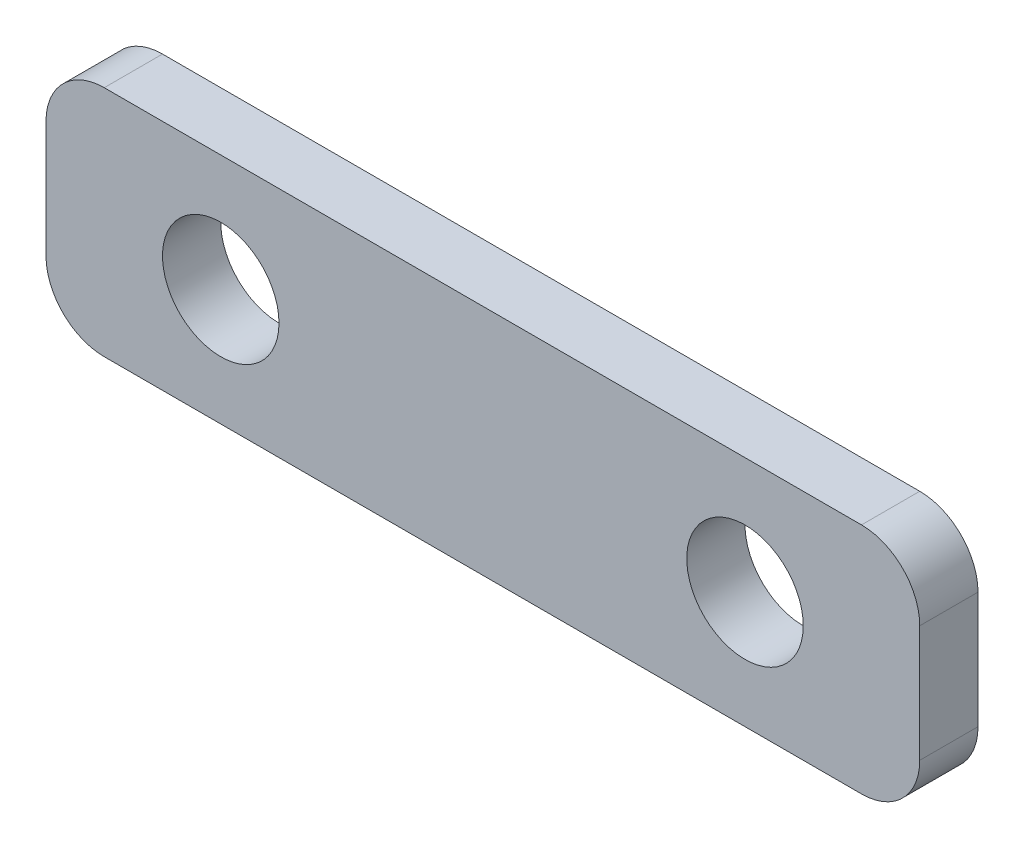
ISO-10303-21;
HEADER;
FILE_DESCRIPTION(('STEP AP214'),'2;1');
FILE_NAME('part.step','',(''),(''),'','','');
FILE_SCHEMA(('AUTOMOTIVE_DESIGN { 1 0 10303 214 1 1 1 1 }'));
ENDSEC;
DATA;
#1=APPLICATION_CONTEXT('core data for automotive mechanical design processes');
#2=APPLICATION_PROTOCOL_DEFINITION('international standard','automotive_design',2000,#1);
#3=PRODUCT_CONTEXT('',#1,'mechanical');
#4=PRODUCT('Part','Part','',(#3));
#5=PRODUCT_RELATED_PRODUCT_CATEGORY('part','',(#4));
#6=PRODUCT_DEFINITION_FORMATION('','',#4);
#7=PRODUCT_DEFINITION_CONTEXT('part definition',#1,'design');
#8=PRODUCT_DEFINITION('design','',#6,#7);
#9=PRODUCT_DEFINITION_SHAPE('','',#8);
#10=(LENGTH_UNIT() NAMED_UNIT(*) SI_UNIT(.MILLI.,.METRE.));
#11=(NAMED_UNIT(*) PLANE_ANGLE_UNIT() SI_UNIT($,.RADIAN.));
#12=(NAMED_UNIT(*) SI_UNIT($,.STERADIAN.) SOLID_ANGLE_UNIT());
#13=UNCERTAINTY_MEASURE_WITH_UNIT(LENGTH_MEASURE(1.E-05),#10,'distance_accuracy_value','');
#14=(GEOMETRIC_REPRESENTATION_CONTEXT(3) GLOBAL_UNCERTAINTY_ASSIGNED_CONTEXT((#13)) GLOBAL_UNIT_ASSIGNED_CONTEXT((#10,
#11,#12)) REPRESENTATION_CONTEXT('',''));
#15=CARTESIAN_POINT('',(0.,0.,0.));
#16=DIRECTION('',(0.,0.,1.));
#17=DIRECTION('',(1.,0.,0.));
#18=AXIS2_PLACEMENT_3D('',#15,#16,#17);
#19=CARTESIAN_POINT('',(-60.,121.755891262732,5.));
#20=DIRECTION('',(0.,0.,1.));
#21=DIRECTION('',(1.,0.,0.));
#22=AXIS2_PLACEMENT_3D('',#19,#20,#21);
#23=PLANE('',#22);
#24=CARTESIAN_POINT('',(-170.,131.755891262732,5.));
#25=DIRECTION('',(0.,0.,1.));
#26=DIRECTION('',(1.,0.,0.));
#27=AXIS2_PLACEMENT_3D('',#24,#25,#26);
#28=CIRCLE('',#27,10.);
#29=CARTESIAN_POINT('',(-160.,131.755891262732,5.));
#30=VERTEX_POINT('',#29);
#31=EDGE_CURVE('E133',#30,#30,#28,.T.);
#32=ORIENTED_EDGE('',*,*,#31,.F.);
#33=EDGE_LOOP('',(#32));
#34=FACE_BOUND('',#33,.T.);
#35=CARTESIAN_POINT('',(-60.,121.755891262732,5.));
#36=DIRECTION('',(0.,0.,1.));
#37=DIRECTION('',(1.,0.,0.));
#38=AXIS2_PLACEMENT_3D('',#35,#36,#37);
#39=CIRCLE('',#38,9.99999999999999);
#40=CARTESIAN_POINT('',(-60.,111.755891262732,5.));
#41=VERTEX_POINT('',#40);
#42=CARTESIAN_POINT('',(-50.,121.755891262732,5.));
#43=VERTEX_POINT('',#42);
#44=EDGE_CURVE('E144',#41,#43,#39,.T.);
#45=ORIENTED_EDGE('',*,*,#44,.T.);
#46=DIRECTION('',(0.,1.,0.));
#47=VECTOR('',#46,1.);
#48=CARTESIAN_POINT('',(-50.,141.755891262732,5.));
#49=LINE('',#48,#47);
#50=CARTESIAN_POINT('',(-50.,141.755891262732,5.));
#51=VERTEX_POINT('',#50);
#52=EDGE_CURVE('E92',#43,#51,#49,.T.);
#53=ORIENTED_EDGE('',*,*,#52,.T.);
#54=CARTESIAN_POINT('',(-60.,141.755891262732,5.));
#55=DIRECTION('',(0.,0.,1.));
#56=DIRECTION('',(-1.,0.,0.));
#57=AXIS2_PLACEMENT_3D('',#54,#55,#56);
#58=CIRCLE('',#57,10.);
#59=CARTESIAN_POINT('',(-60.,151.755891262732,5.));
#60=VERTEX_POINT('',#59);
#61=EDGE_CURVE('E159',#51,#60,#58,.T.);
#62=ORIENTED_EDGE('',*,*,#61,.T.);
#63=DIRECTION('',(-1.,0.,0.));
#64=VECTOR('',#63,1.);
#65=CARTESIAN_POINT('',(-190.,151.755891262732,5.));
#66=LINE('',#65,#64);
#67=CARTESIAN_POINT('',(-190.,151.755891262732,5.));
#68=VERTEX_POINT('',#67);
#69=EDGE_CURVE('E172',#60,#68,#66,.T.);
#70=ORIENTED_EDGE('',*,*,#69,.T.);
#71=CARTESIAN_POINT('',(-190.,141.755891262732,5.));
#72=DIRECTION('',(0.,0.,1.));
#73=DIRECTION('',(1.,0.,0.));
#74=AXIS2_PLACEMENT_3D('',#71,#72,#73);
#75=CIRCLE('',#74,10.);
#76=CARTESIAN_POINT('',(-200.,141.755891262732,5.));
#77=VERTEX_POINT('',#76);
#78=EDGE_CURVE('E111',#68,#77,#75,.T.);
#79=ORIENTED_EDGE('',*,*,#78,.T.);
#80=DIRECTION('',(0.,-1.,0.));
#81=VECTOR('',#80,1.);
#82=CARTESIAN_POINT('',(-200.,141.755891262732,5.));
#83=LINE('',#82,#81);
#84=CARTESIAN_POINT('',(-200.,121.755891262732,5.));
#85=VERTEX_POINT('',#84);
#86=EDGE_CURVE('E105',#77,#85,#83,.T.);
#87=ORIENTED_EDGE('',*,*,#86,.T.);
#88=CARTESIAN_POINT('',(-190.,121.755891262732,5.));
#89=DIRECTION('',(0.,0.,1.));
#90=DIRECTION('',(1.,0.,0.));
#91=AXIS2_PLACEMENT_3D('',#88,#89,#90);
#92=CIRCLE('',#91,10.);
#93=CARTESIAN_POINT('',(-190.,111.755891262732,5.));
#94=VERTEX_POINT('',#93);
#95=EDGE_CURVE('E109',#85,#94,#92,.T.);
#96=ORIENTED_EDGE('',*,*,#95,.T.);
#97=DIRECTION('',(1.,0.,0.));
#98=VECTOR('',#97,1.);
#99=CARTESIAN_POINT('',(-190.,111.755891262732,5.));
#100=LINE('',#99,#98);
#101=EDGE_CURVE('E49',#94,#41,#100,.T.);
#102=ORIENTED_EDGE('',*,*,#101,.T.);
#103=EDGE_LOOP('',(#45,#53,#62,#70,#79,#87,#96,#102));
#104=FACE_BOUND('',#103,.T.);
#105=CARTESIAN_POINT('',(-80.,131.755891262732,5.));
#106=DIRECTION('',(0.,0.,1.));
#107=DIRECTION('',(1.,0.,0.));
#108=AXIS2_PLACEMENT_3D('',#105,#106,#107);
#109=CIRCLE('',#108,10.);
#110=CARTESIAN_POINT('',(-70.,131.755891262732,5.));
#111=VERTEX_POINT('',#110);
#112=EDGE_CURVE('E181',#111,#111,#109,.T.);
#113=ORIENTED_EDGE('',*,*,#112,.F.);
#114=EDGE_LOOP('',(#113));
#115=FACE_BOUND('',#114,.T.);
#116=ADVANCED_FACE('F32',(#34,#104,#115),#23,.T.);
#117=CARTESIAN_POINT('',(-60.,121.755891262732,-5.));
#118=DIRECTION('',(0.,0.,1.));
#119=DIRECTION('',(1.,0.,0.));
#120=AXIS2_PLACEMENT_3D('',#117,#118,#119);
#121=PLANE('',#120);
#122=CARTESIAN_POINT('',(-60.,121.755891262732,-5.));
#123=DIRECTION('',(0.,0.,1.));
#124=DIRECTION('',(1.,0.,0.));
#125=AXIS2_PLACEMENT_3D('',#122,#123,#124);
#126=CIRCLE('',#125,9.99999999999999);
#127=CARTESIAN_POINT('',(-60.,111.755891262732,-5.));
#128=VERTEX_POINT('',#127);
#129=CARTESIAN_POINT('',(-50.,121.755891262732,-5.));
#130=VERTEX_POINT('',#129);
#131=EDGE_CURVE('E129',#128,#130,#126,.T.);
#132=ORIENTED_EDGE('',*,*,#131,.F.);
#133=DIRECTION('',(1.,0.,0.));
#134=VECTOR('',#133,1.);
#135=CARTESIAN_POINT('',(-190.,111.755891262732,-5.));
#136=LINE('',#135,#134);
#137=CARTESIAN_POINT('',(-190.,111.755891262732,-5.));
#138=VERTEX_POINT('',#137);
#139=EDGE_CURVE('E84',#138,#128,#136,.T.);
#140=ORIENTED_EDGE('',*,*,#139,.F.);
#141=CARTESIAN_POINT('',(-190.,121.755891262732,-5.));
#142=DIRECTION('',(0.,0.,1.));
#143=DIRECTION('',(1.,0.,0.));
#144=AXIS2_PLACEMENT_3D('',#141,#142,#143);
#145=CIRCLE('',#144,10.);
#146=CARTESIAN_POINT('',(-200.,121.755891262732,-5.));
#147=VERTEX_POINT('',#146);
#148=EDGE_CURVE('E78',#147,#138,#145,.T.);
#149=ORIENTED_EDGE('',*,*,#148,.F.);
#150=DIRECTION('',(0.,-1.,0.));
#151=VECTOR('',#150,1.);
#152=CARTESIAN_POINT('',(-200.,141.755891262732,-5.));
#153=LINE('',#152,#151);
#154=CARTESIAN_POINT('',(-200.,141.755891262732,-5.));
#155=VERTEX_POINT('',#154);
#156=EDGE_CURVE('E119',#155,#147,#153,.T.);
#157=ORIENTED_EDGE('',*,*,#156,.F.);
#158=CARTESIAN_POINT('',(-190.,141.755891262732,-5.));
#159=DIRECTION('',(0.,0.,1.));
#160=DIRECTION('',(1.,0.,0.));
#161=AXIS2_PLACEMENT_3D('',#158,#159,#160);
#162=CIRCLE('',#161,10.);
#163=CARTESIAN_POINT('',(-190.,151.755891262732,-5.));
#164=VERTEX_POINT('',#163);
#165=EDGE_CURVE('E139',#164,#155,#162,.T.);
#166=ORIENTED_EDGE('',*,*,#165,.F.);
#167=DIRECTION('',(-1.,0.,0.));
#168=VECTOR('',#167,1.);
#169=CARTESIAN_POINT('',(-190.,151.755891262732,-5.));
#170=LINE('',#169,#168);
#171=CARTESIAN_POINT('',(-60.,151.755891262732,-5.));
#172=VERTEX_POINT('',#171);
#173=EDGE_CURVE('E137',#172,#164,#170,.T.);
#174=ORIENTED_EDGE('',*,*,#173,.F.);
#175=CARTESIAN_POINT('',(-60.,141.755891262732,-5.));
#176=DIRECTION('',(0.,0.,1.));
#177=DIRECTION('',(-1.,0.,0.));
#178=AXIS2_PLACEMENT_3D('',#175,#176,#177);
#179=CIRCLE('',#178,10.);
#180=CARTESIAN_POINT('',(-50.,141.755891262732,-5.));
#181=VERTEX_POINT('',#180);
#182=EDGE_CURVE('E135',#181,#172,#179,.T.);
#183=ORIENTED_EDGE('',*,*,#182,.F.);
#184=DIRECTION('',(0.,1.,0.));
#185=VECTOR('',#184,1.);
#186=CARTESIAN_POINT('',(-50.,141.755891262732,-5.));
#187=LINE('',#186,#185);
#188=EDGE_CURVE('E132',#130,#181,#187,.T.);
#189=ORIENTED_EDGE('',*,*,#188,.F.);
#190=EDGE_LOOP('',(#132,#140,#149,#157,#166,#174,#183,#189));
#191=FACE_BOUND('',#190,.T.);
#192=CARTESIAN_POINT('',(-170.,131.755891262732,-5.));
#193=DIRECTION('',(0.,0.,1.));
#194=DIRECTION('',(1.,0.,0.));
#195=AXIS2_PLACEMENT_3D('',#192,#193,#194);
#196=CIRCLE('',#195,10.);
#197=CARTESIAN_POINT('',(-160.,131.755891262732,-5.));
#198=VERTEX_POINT('',#197);
#199=EDGE_CURVE('E178',#198,#198,#196,.T.);
#200=ORIENTED_EDGE('',*,*,#199,.T.);
#201=EDGE_LOOP('',(#200));
#202=FACE_BOUND('',#201,.T.);
#203=CARTESIAN_POINT('',(-80.,131.755891262732,-5.));
#204=DIRECTION('',(0.,0.,1.));
#205=DIRECTION('',(1.,0.,0.));
#206=AXIS2_PLACEMENT_3D('',#203,#204,#205);
#207=CIRCLE('',#206,10.);
#208=CARTESIAN_POINT('',(-70.,131.755891262732,-5.));
#209=VERTEX_POINT('',#208);
#210=EDGE_CURVE('E184',#209,#209,#207,.T.);
#211=ORIENTED_EDGE('',*,*,#210,.T.);
#212=EDGE_LOOP('',(#211));
#213=FACE_BOUND('',#212,.T.);
#214=ADVANCED_FACE('F163',(#191,#202,#213),#121,.F.);
#215=CARTESIAN_POINT('',(-60.,121.755891262732,5.));
#216=DIRECTION('',(0.,0.,-1.));
#217=DIRECTION('',(-1.,0.,0.));
#218=AXIS2_PLACEMENT_3D('',#215,#216,#217);
#219=CYLINDRICAL_SURFACE('',#218,9.99999999999999);
#220=ORIENTED_EDGE('',*,*,#131,.T.);
#221=DIRECTION('',(0.,0.,-1.));
#222=VECTOR('',#221,1.);
#223=CARTESIAN_POINT('',(-50.,121.755891262732,5.));
#224=LINE('',#223,#222);
#225=EDGE_CURVE('E11',#43,#130,#224,.T.);
#226=ORIENTED_EDGE('',*,*,#225,.F.);
#227=ORIENTED_EDGE('',*,*,#44,.F.);
#228=DIRECTION('',(0.,0.,-1.));
#229=VECTOR('',#228,1.);
#230=CARTESIAN_POINT('',(-60.,111.755891262732,5.));
#231=LINE('',#230,#229);
#232=EDGE_CURVE('E125',#41,#128,#231,.T.);
#233=ORIENTED_EDGE('',*,*,#232,.T.);
#234=EDGE_LOOP('',(#220,#226,#227,#233));
#235=FACE_BOUND('',#234,.T.);
#236=ADVANCED_FACE('F34',(#235),#219,.T.);
#237=CARTESIAN_POINT('',(-50.,141.755891262732,5.));
#238=DIRECTION('',(-1.,0.,0.));
#239=DIRECTION('',(0.,-1.,0.));
#240=AXIS2_PLACEMENT_3D('',#237,#238,#239);
#241=PLANE('',#240);
#242=ORIENTED_EDGE('',*,*,#188,.T.);
#243=DIRECTION('',(0.,0.,-1.));
#244=VECTOR('',#243,1.);
#245=CARTESIAN_POINT('',(-50.,141.755891262732,5.));
#246=LINE('',#245,#244);
#247=EDGE_CURVE('E41',#51,#181,#246,.T.);
#248=ORIENTED_EDGE('',*,*,#247,.F.);
#249=ORIENTED_EDGE('',*,*,#52,.F.);
#250=ORIENTED_EDGE('',*,*,#225,.T.);
#251=EDGE_LOOP('',(#242,#248,#249,#250));
#252=FACE_BOUND('',#251,.T.);
#253=ADVANCED_FACE('F216',(#252),#241,.F.);
#254=CARTESIAN_POINT('',(-60.,141.755891262732,5.));
#255=DIRECTION('',(0.,0.,-1.));
#256=DIRECTION('',(-1.,0.,0.));
#257=AXIS2_PLACEMENT_3D('',#254,#255,#256);
#258=CYLINDRICAL_SURFACE('',#257,10.);
#259=ORIENTED_EDGE('',*,*,#182,.T.);
#260=DIRECTION('',(0.,0.,-1.));
#261=VECTOR('',#260,1.);
#262=CARTESIAN_POINT('',(-60.,151.755891262732,5.));
#263=LINE('',#262,#261);
#264=EDGE_CURVE('E151',#60,#172,#263,.T.);
#265=ORIENTED_EDGE('',*,*,#264,.F.);
#266=ORIENTED_EDGE('',*,*,#61,.F.);
#267=ORIENTED_EDGE('',*,*,#247,.T.);
#268=EDGE_LOOP('',(#259,#265,#266,#267));
#269=FACE_BOUND('',#268,.T.);
#270=ADVANCED_FACE('F157',(#269),#258,.T.);
#271=CARTESIAN_POINT('',(-190.,151.755891262732,5.));
#272=DIRECTION('',(0.,-1.,0.));
#273=DIRECTION('',(0.,0.,-1.));
#274=AXIS2_PLACEMENT_3D('',#271,#272,#273);
#275=PLANE('',#274);
#276=ORIENTED_EDGE('',*,*,#173,.T.);
#277=DIRECTION('',(0.,0.,-1.));
#278=VECTOR('',#277,1.);
#279=CARTESIAN_POINT('',(-190.,151.755891262732,5.));
#280=LINE('',#279,#278);
#281=EDGE_CURVE('E148',#68,#164,#280,.T.);
#282=ORIENTED_EDGE('',*,*,#281,.F.);
#283=ORIENTED_EDGE('',*,*,#69,.F.);
#284=ORIENTED_EDGE('',*,*,#264,.T.);
#285=EDGE_LOOP('',(#276,#282,#283,#284));
#286=FACE_BOUND('',#285,.T.);
#287=ADVANCED_FACE('F168',(#286),#275,.F.);
#288=CARTESIAN_POINT('',(-190.,141.755891262732,5.));
#289=DIRECTION('',(0.,0.,-1.));
#290=DIRECTION('',(-1.,0.,0.));
#291=AXIS2_PLACEMENT_3D('',#288,#289,#290);
#292=CYLINDRICAL_SURFACE('',#291,10.);
#293=ORIENTED_EDGE('',*,*,#165,.T.);
#294=DIRECTION('',(0.,0.,-1.));
#295=VECTOR('',#294,1.);
#296=CARTESIAN_POINT('',(-200.,141.755891262732,5.));
#297=LINE('',#296,#295);
#298=EDGE_CURVE('E120',#77,#155,#297,.T.);
#299=ORIENTED_EDGE('',*,*,#298,.F.);
#300=ORIENTED_EDGE('',*,*,#78,.F.);
#301=ORIENTED_EDGE('',*,*,#281,.T.);
#302=EDGE_LOOP('',(#293,#299,#300,#301));
#303=FACE_BOUND('',#302,.T.);
#304=ADVANCED_FACE('F171',(#303),#292,.T.);
#305=CARTESIAN_POINT('',(-200.,141.755891262732,5.));
#306=DIRECTION('',(1.,0.,0.));
#307=DIRECTION('',(0.,0.,-1.));
#308=AXIS2_PLACEMENT_3D('',#305,#306,#307);
#309=PLANE('',#308);
#310=ORIENTED_EDGE('',*,*,#156,.T.);
#311=DIRECTION('',(0.,0.,-1.));
#312=VECTOR('',#311,1.);
#313=CARTESIAN_POINT('',(-200.,121.755891262732,5.));
#314=LINE('',#313,#312);
#315=EDGE_CURVE('E116',#85,#147,#314,.T.);
#316=ORIENTED_EDGE('',*,*,#315,.F.);
#317=ORIENTED_EDGE('',*,*,#86,.F.);
#318=ORIENTED_EDGE('',*,*,#298,.T.);
#319=EDGE_LOOP('',(#310,#316,#317,#318));
#320=FACE_BOUND('',#319,.T.);
#321=ADVANCED_FACE('F117',(#320),#309,.F.);
#322=CARTESIAN_POINT('',(-190.,121.755891262732,5.));
#323=DIRECTION('',(0.,0.,-1.));
#324=DIRECTION('',(-1.,0.,0.));
#325=AXIS2_PLACEMENT_3D('',#322,#323,#324);
#326=CYLINDRICAL_SURFACE('',#325,10.);
#327=ORIENTED_EDGE('',*,*,#148,.T.);
#328=DIRECTION('',(0.,0.,-1.));
#329=VECTOR('',#328,1.);
#330=CARTESIAN_POINT('',(-190.,111.755891262732,5.));
#331=LINE('',#330,#329);
#332=EDGE_CURVE('E121',#94,#138,#331,.T.);
#333=ORIENTED_EDGE('',*,*,#332,.F.);
#334=ORIENTED_EDGE('',*,*,#95,.F.);
#335=ORIENTED_EDGE('',*,*,#315,.T.);
#336=EDGE_LOOP('',(#327,#333,#334,#335));
#337=FACE_BOUND('',#336,.T.);
#338=ADVANCED_FACE('F123',(#337),#326,.T.);
#339=CARTESIAN_POINT('',(-190.,111.755891262732,5.));
#340=DIRECTION('',(0.,1.,0.));
#341=DIRECTION('',(-1.,0.,0.));
#342=AXIS2_PLACEMENT_3D('',#339,#340,#341);
#343=PLANE('',#342);
#344=ORIENTED_EDGE('',*,*,#139,.T.);
#345=ORIENTED_EDGE('',*,*,#232,.F.);
#346=ORIENTED_EDGE('',*,*,#101,.F.);
#347=ORIENTED_EDGE('',*,*,#332,.T.);
#348=EDGE_LOOP('',(#344,#345,#346,#347));
#349=FACE_BOUND('',#348,.T.);
#350=ADVANCED_FACE('F204',(#349),#343,.F.);
#351=CARTESIAN_POINT('',(-170.,131.755891262732,5.));
#352=DIRECTION('',(0.,0.,-1.));
#353=DIRECTION('',(-1.,0.,0.));
#354=AXIS2_PLACEMENT_3D('',#351,#352,#353);
#355=CYLINDRICAL_SURFACE('',#354,10.);
#356=ORIENTED_EDGE('',*,*,#31,.T.);
#357=EDGE_LOOP('',(#356));
#358=FACE_BOUND('',#357,.T.);
#359=ORIENTED_EDGE('',*,*,#199,.F.);
#360=EDGE_LOOP('',(#359));
#361=FACE_BOUND('',#360,.T.);
#362=ADVANCED_FACE('F201',(#358,#361),#355,.F.);
#363=CARTESIAN_POINT('',(-80.,131.755891262732,5.));
#364=DIRECTION('',(0.,0.,-1.));
#365=DIRECTION('',(-1.,0.,0.));
#366=AXIS2_PLACEMENT_3D('',#363,#364,#365);
#367=CYLINDRICAL_SURFACE('',#366,10.);
#368=ORIENTED_EDGE('',*,*,#112,.T.);
#369=EDGE_LOOP('',(#368));
#370=FACE_BOUND('',#369,.T.);
#371=ORIENTED_EDGE('',*,*,#210,.F.);
#372=EDGE_LOOP('',(#371));
#373=FACE_BOUND('',#372,.T.);
#374=ADVANCED_FACE('F190',(#370,#373),#367,.F.);
#375=CLOSED_SHELL('',(#116,#214,#236,#253,#270,#287,#304,#321,#338,#350,#362,#374));
#376=MANIFOLD_SOLID_BREP('B2',#375);
#377=ADVANCED_BREP_SHAPE_REPRESENTATION('',(#18,#376),#14);
#378=SHAPE_DEFINITION_REPRESENTATION(#9,#377);
ENDSEC;
END-ISO-10303-21;
